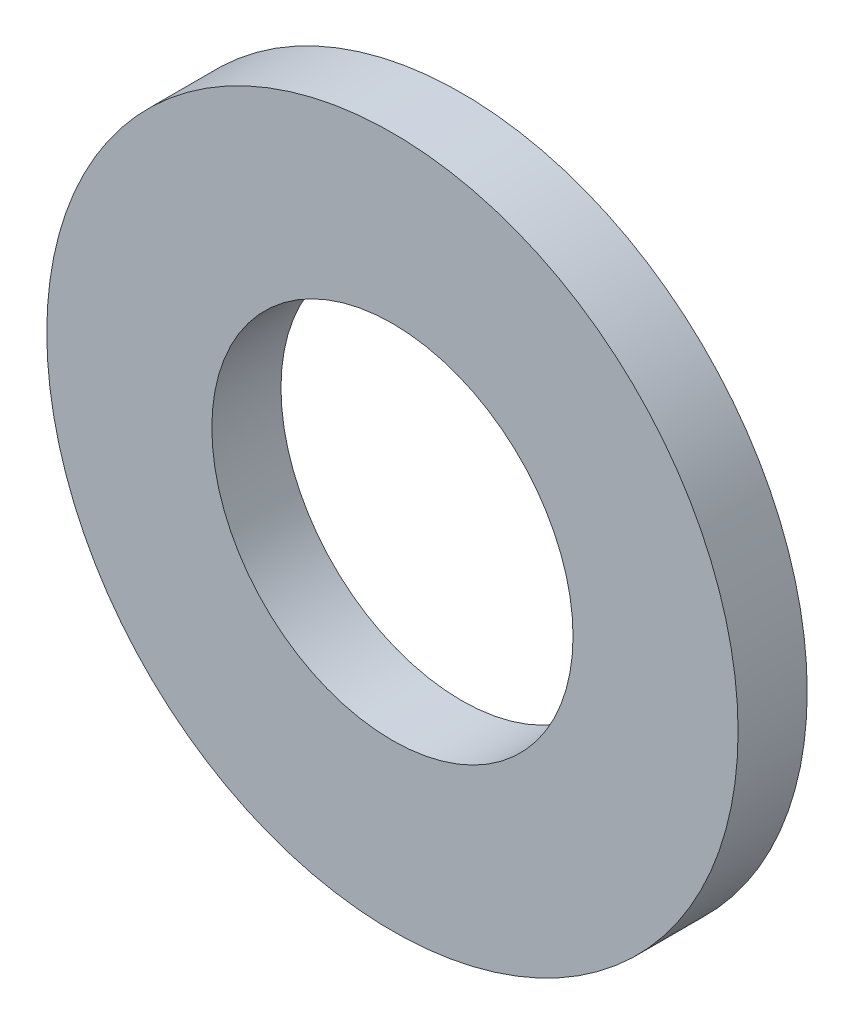
ISO-10303-21;
HEADER;
FILE_DESCRIPTION(('STEP AP214'),'2;1');
FILE_NAME('part.step','',(''),(''),'','','');
FILE_SCHEMA(('AUTOMOTIVE_DESIGN { 1 0 10303 214 1 1 1 1 }'));
ENDSEC;
DATA;
#1=APPLICATION_CONTEXT('core data for automotive mechanical design processes');
#2=APPLICATION_PROTOCOL_DEFINITION('international standard','automotive_design',2000,#1);
#3=PRODUCT_CONTEXT('',#1,'mechanical');
#4=PRODUCT('Part','Part','',(#3));
#5=PRODUCT_RELATED_PRODUCT_CATEGORY('part','',(#4));
#6=PRODUCT_DEFINITION_FORMATION('','',#4);
#7=PRODUCT_DEFINITION_CONTEXT('part definition',#1,'design');
#8=PRODUCT_DEFINITION('design','',#6,#7);
#9=PRODUCT_DEFINITION_SHAPE('','',#8);
#10=(LENGTH_UNIT() NAMED_UNIT(*) SI_UNIT(.MILLI.,.METRE.));
#11=(NAMED_UNIT(*) PLANE_ANGLE_UNIT() SI_UNIT($,.RADIAN.));
#12=(NAMED_UNIT(*) SI_UNIT($,.STERADIAN.) SOLID_ANGLE_UNIT());
#13=UNCERTAINTY_MEASURE_WITH_UNIT(LENGTH_MEASURE(1.E-05),#10,'distance_accuracy_value','');
#14=(GEOMETRIC_REPRESENTATION_CONTEXT(3) GLOBAL_UNCERTAINTY_ASSIGNED_CONTEXT((#13)) GLOBAL_UNIT_ASSIGNED_CONTEXT((#10,
#11,#12)) REPRESENTATION_CONTEXT('',''));
#15=CARTESIAN_POINT('',(0.,0.,0.));
#16=DIRECTION('',(0.,0.,1.));
#17=DIRECTION('',(1.,0.,0.));
#18=AXIS2_PLACEMENT_3D('',#15,#16,#17);
#19=CARTESIAN_POINT('',(0.,0.,-0.8));
#20=DIRECTION('',(0.,0.,1.));
#21=DIRECTION('',(1.,0.,0.));
#22=AXIS2_PLACEMENT_3D('',#19,#20,#21);
#23=CYLINDRICAL_SURFACE('',#22,4.);
#24=CARTESIAN_POINT('',(0.,0.,-0.8));
#25=DIRECTION('',(0.,0.,1.));
#26=DIRECTION('',(1.,0.,0.));
#27=AXIS2_PLACEMENT_3D('',#24,#25,#26);
#28=CIRCLE('',#27,4.);
#29=CARTESIAN_POINT('',(4.,0.,-0.8));
#30=VERTEX_POINT('',#29);
#31=EDGE_CURVE('E10',#30,#30,#28,.T.);
#32=ORIENTED_EDGE('',*,*,#31,.T.);
#33=EDGE_LOOP('',(#32));
#34=FACE_BOUND('',#33,.T.);
#35=CARTESIAN_POINT('',(0.,0.,0.));
#36=DIRECTION('',(0.,0.,1.));
#37=DIRECTION('',(1.,0.,0.));
#38=AXIS2_PLACEMENT_3D('',#35,#36,#37);
#39=CIRCLE('',#38,4.);
#40=CARTESIAN_POINT('',(4.,0.,0.));
#41=VERTEX_POINT('',#40);
#42=EDGE_CURVE('E34',#41,#41,#39,.T.);
#43=ORIENTED_EDGE('',*,*,#42,.F.);
#44=EDGE_LOOP('',(#43));
#45=FACE_BOUND('',#44,.T.);
#46=ADVANCED_FACE('F31',(#34,#45),#23,.T.);
#47=CARTESIAN_POINT('',(0.,0.,-0.8));
#48=DIRECTION('',(0.,0.,1.));
#49=DIRECTION('',(1.,0.,0.));
#50=AXIS2_PLACEMENT_3D('',#47,#48,#49);
#51=PLANE('',#50);
#52=CARTESIAN_POINT('',(0.,0.,-0.8));
#53=DIRECTION('',(0.,0.,1.));
#54=DIRECTION('',(1.,0.,0.));
#55=AXIS2_PLACEMENT_3D('',#52,#53,#54);
#56=CIRCLE('',#55,2.09);
#57=CARTESIAN_POINT('',(2.09,0.,-0.8));
#58=VERTEX_POINT('',#57);
#59=EDGE_CURVE('E41',#58,#58,#56,.T.);
#60=ORIENTED_EDGE('',*,*,#59,.T.);
#61=EDGE_LOOP('',(#60));
#62=FACE_BOUND('',#61,.T.);
#63=ORIENTED_EDGE('',*,*,#31,.F.);
#64=EDGE_LOOP('',(#63));
#65=FACE_BOUND('',#64,.T.);
#66=ADVANCED_FACE('F49',(#62,#65),#51,.F.);
#67=CARTESIAN_POINT('',(0.,0.,0.));
#68=DIRECTION('',(0.,0.,1.));
#69=DIRECTION('',(1.,0.,0.));
#70=AXIS2_PLACEMENT_3D('',#67,#68,#69);
#71=PLANE('',#70);
#72=CARTESIAN_POINT('',(0.,0.,0.));
#73=DIRECTION('',(0.,0.,1.));
#74=DIRECTION('',(1.,0.,0.));
#75=AXIS2_PLACEMENT_3D('',#72,#73,#74);
#76=CIRCLE('',#75,2.09);
#77=CARTESIAN_POINT('',(2.09,0.,0.));
#78=VERTEX_POINT('',#77);
#79=EDGE_CURVE('E43',#78,#78,#76,.T.);
#80=ORIENTED_EDGE('',*,*,#79,.F.);
#81=EDGE_LOOP('',(#80));
#82=FACE_BOUND('',#81,.T.);
#83=ORIENTED_EDGE('',*,*,#42,.T.);
#84=EDGE_LOOP('',(#83));
#85=FACE_BOUND('',#84,.T.);
#86=ADVANCED_FACE('F55',(#82,#85),#71,.T.);
#87=CARTESIAN_POINT('',(0.,0.,-0.8));
#88=DIRECTION('',(0.,0.,1.));
#89=DIRECTION('',(1.,0.,0.));
#90=AXIS2_PLACEMENT_3D('',#87,#88,#89);
#91=CYLINDRICAL_SURFACE('',#90,2.09);
#92=ORIENTED_EDGE('',*,*,#59,.F.);
#93=EDGE_LOOP('',(#92));
#94=FACE_BOUND('',#93,.T.);
#95=ORIENTED_EDGE('',*,*,#79,.T.);
#96=EDGE_LOOP('',(#95));
#97=FACE_BOUND('',#96,.T.);
#98=ADVANCED_FACE('F52',(#94,#97),#91,.F.);
#99=CLOSED_SHELL('',(#46,#66,#86,#98));
#100=MANIFOLD_SOLID_BREP('B2',#99);
#101=ADVANCED_BREP_SHAPE_REPRESENTATION('',(#18,#100),#14);
#102=SHAPE_DEFINITION_REPRESENTATION(#9,#101);
ENDSEC;
END-ISO-10303-21;
